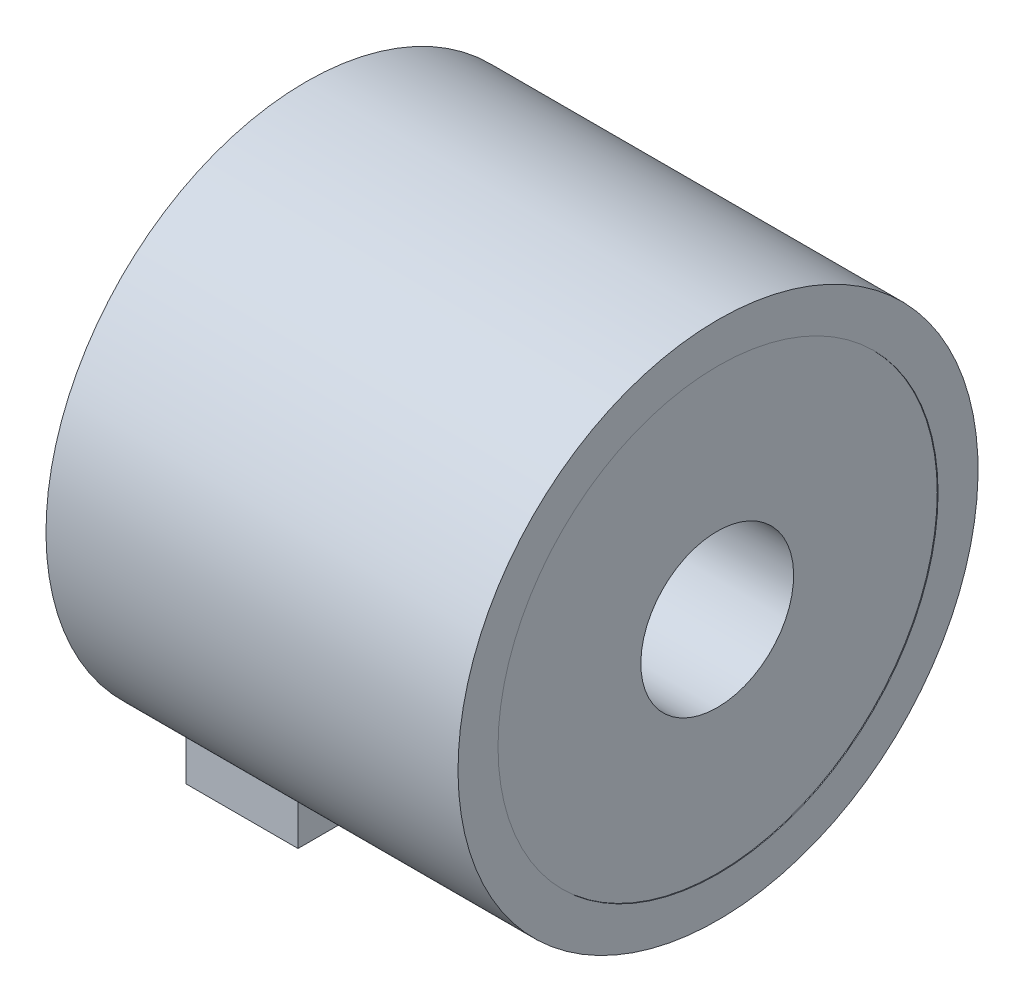
ISO-10303-21;
HEADER;
FILE_DESCRIPTION(('STEP AP214'),'2;1');
FILE_NAME('part.step','',(''),(''),'','','');
FILE_SCHEMA(('AUTOMOTIVE_DESIGN { 1 0 10303 214 1 1 1 1 }'));
ENDSEC;
DATA;
#1=APPLICATION_CONTEXT('core data for automotive mechanical design processes');
#2=APPLICATION_PROTOCOL_DEFINITION('international standard','automotive_design',2000,#1);
#3=PRODUCT_CONTEXT('',#1,'mechanical');
#4=PRODUCT('Part','Part','',(#3));
#5=PRODUCT_RELATED_PRODUCT_CATEGORY('part','',(#4));
#6=PRODUCT_DEFINITION_FORMATION('','',#4);
#7=PRODUCT_DEFINITION_CONTEXT('part definition',#1,'design');
#8=PRODUCT_DEFINITION('design','',#6,#7);
#9=PRODUCT_DEFINITION_SHAPE('','',#8);
#10=(LENGTH_UNIT() NAMED_UNIT(*) SI_UNIT(.MILLI.,.METRE.));
#11=(NAMED_UNIT(*) PLANE_ANGLE_UNIT() SI_UNIT($,.RADIAN.));
#12=(NAMED_UNIT(*) SI_UNIT($,.STERADIAN.) SOLID_ANGLE_UNIT());
#13=UNCERTAINTY_MEASURE_WITH_UNIT(LENGTH_MEASURE(1.E-05),#10,'distance_accuracy_value','');
#14=(GEOMETRIC_REPRESENTATION_CONTEXT(3) GLOBAL_UNCERTAINTY_ASSIGNED_CONTEXT((#13)) GLOBAL_UNIT_ASSIGNED_CONTEXT((#10,
#11,#12)) REPRESENTATION_CONTEXT('',''));
#15=CARTESIAN_POINT('',(0.,0.,0.));
#16=DIRECTION('',(0.,0.,1.));
#17=DIRECTION('',(1.,0.,0.));
#18=AXIS2_PLACEMENT_3D('',#15,#16,#17);
#19=CARTESIAN_POINT('',(-7.1882,0.,0.));
#20=DIRECTION('',(1.,0.,0.));
#21=DIRECTION('',(0.,0.,1.));
#22=AXIS2_PLACEMENT_3D('',#19,#20,#21);
#23=PLANE('',#22);
#24=CARTESIAN_POINT('',(-7.1882,0.,0.));
#25=DIRECTION('',(-1.,0.,0.));
#26=DIRECTION('',(0.,1.,0.));
#27=AXIS2_PLACEMENT_3D('',#24,#25,#26);
#28=CIRCLE('',#27,2.4257);
#29=CARTESIAN_POINT('',(-7.1882,-2.4257,0.));
#30=VERTEX_POINT('',#29);
#31=EDGE_CURVE('E132',#30,#30,#28,.T.);
#32=ORIENTED_EDGE('',*,*,#31,.T.);
#33=EDGE_LOOP('',(#32));
#34=FACE_BOUND('',#33,.T.);
#35=CARTESIAN_POINT('',(-7.1882,0.,0.));
#36=DIRECTION('',(1.,0.,0.));
#37=DIRECTION('',(0.,1.,0.));
#38=AXIS2_PLACEMENT_3D('',#35,#36,#37);
#39=CIRCLE('',#38,6.985);
#40=CARTESIAN_POINT('',(-7.1882,6.985,0.));
#41=VERTEX_POINT('',#40);
#42=EDGE_CURVE('E123',#41,#41,#39,.T.);
#43=ORIENTED_EDGE('',*,*,#42,.T.);
#44=EDGE_LOOP('',(#43));
#45=FACE_BOUND('',#44,.T.);
#46=ADVANCED_FACE('F17',(#34,#45),#23,.T.);
#47=CARTESIAN_POINT('',(-20.2184,0.,0.));
#48=DIRECTION('',(-1.,0.,0.));
#49=DIRECTION('',(0.,0.,1.));
#50=AXIS2_PLACEMENT_3D('',#47,#48,#49);
#51=PLANE('',#50);
#52=CARTESIAN_POINT('',(-20.2184,0.,0.));
#53=DIRECTION('',(1.,0.,0.));
#54=DIRECTION('',(0.,-1.,0.));
#55=AXIS2_PLACEMENT_3D('',#52,#53,#54);
#56=CIRCLE('',#55,2.4257);
#57=CARTESIAN_POINT('',(-20.2184,-2.4257,0.));
#58=VERTEX_POINT('',#57);
#59=EDGE_CURVE('E135',#58,#58,#56,.T.);
#60=ORIENTED_EDGE('',*,*,#59,.T.);
#61=EDGE_LOOP('',(#60));
#62=FACE_BOUND('',#61,.T.);
#63=CARTESIAN_POINT('',(-20.2184,0.,0.));
#64=DIRECTION('',(-1.,0.,0.));
#65=DIRECTION('',(0.,-1.,0.));
#66=AXIS2_PLACEMENT_3D('',#63,#64,#65);
#67=CIRCLE('',#66,6.985);
#68=CARTESIAN_POINT('',(-20.2184,-6.985,0.));
#69=VERTEX_POINT('',#68);
#70=EDGE_CURVE('E109',#69,#69,#67,.T.);
#71=ORIENTED_EDGE('',*,*,#70,.T.);
#72=EDGE_LOOP('',(#71));
#73=FACE_BOUND('',#72,.T.);
#74=ADVANCED_FACE('F311',(#62,#73),#51,.T.);
#75=CARTESIAN_POINT('',(-17.9578,-8.128,0.5588));
#76=DIRECTION('',(0.,-1.,0.));
#77=DIRECTION('',(-1.,0.,0.));
#78=AXIS2_PLACEMENT_3D('',#75,#76,#77);
#79=PLANE('',#78);
#80=CARTESIAN_POINT('',(-17.9578,-8.128,0.5588));
#81=DIRECTION('',(0.,-1.,0.));
#82=DIRECTION('',(0.,0.,1.));
#83=AXIS2_PLACEMENT_3D('',#80,#81,#82);
#84=CIRCLE('',#83,0.508);
#85=CARTESIAN_POINT('',(-17.9578,-8.128,1.0668));
#86=VERTEX_POINT('',#85);
#87=EDGE_CURVE('E108',#86,#86,#84,.T.);
#88=ORIENTED_EDGE('',*,*,#87,.T.);
#89=EDGE_LOOP('',(#88));
#90=FACE_BOUND('',#89,.T.);
#91=ADVANCED_FACE('F307',(#90),#79,.T.);
#92=CARTESIAN_POINT('',(-17.9578,-8.128,-0.5588));
#93=DIRECTION('',(0.,-1.,0.));
#94=DIRECTION('',(-1.,0.,0.));
#95=AXIS2_PLACEMENT_3D('',#92,#93,#94);
#96=PLANE('',#95);
#97=CARTESIAN_POINT('',(-17.9578,-8.128,-0.5588));
#98=DIRECTION('',(0.,-1.,0.));
#99=DIRECTION('',(0.,0.,1.));
#100=AXIS2_PLACEMENT_3D('',#97,#98,#99);
#101=CIRCLE('',#100,0.508);
#102=CARTESIAN_POINT('',(-17.9578,-8.128,-0.0508));
#103=VERTEX_POINT('',#102);
#104=EDGE_CURVE('E125',#103,#103,#101,.T.);
#105=ORIENTED_EDGE('',*,*,#104,.T.);
#106=EDGE_LOOP('',(#105));
#107=FACE_BOUND('',#106,.T.);
#108=ADVANCED_FACE('F285',(#107),#96,.T.);
#109=CARTESIAN_POINT('',(-16.6878,-9.144,-3.81));
#110=DIRECTION('',(0.,-1.,0.));
#111=DIRECTION('',(-1.,0.,0.));
#112=AXIS2_PLACEMENT_3D('',#109,#110,#111);
#113=PLANE('',#112);
#114=CARTESIAN_POINT('',(-17.9578,-9.144,-0.5588));
#115=DIRECTION('',(0.,-1.,0.));
#116=DIRECTION('',(0.,0.,1.));
#117=AXIS2_PLACEMENT_3D('',#114,#115,#116);
#118=CIRCLE('',#117,0.508);
#119=CARTESIAN_POINT('',(-17.9578,-9.144,-0.0508));
#120=VERTEX_POINT('',#119);
#121=EDGE_CURVE('E127',#120,#120,#118,.T.);
#122=ORIENTED_EDGE('',*,*,#121,.F.);
#123=EDGE_LOOP('',(#122));
#124=FACE_BOUND('',#123,.T.);
#125=CARTESIAN_POINT('',(-17.9578,-9.144,0.5588));
#126=DIRECTION('',(0.,-1.,0.));
#127=DIRECTION('',(0.,0.,1.));
#128=AXIS2_PLACEMENT_3D('',#125,#126,#127);
#129=CIRCLE('',#128,0.508);
#130=CARTESIAN_POINT('',(-17.9578,-9.144,1.0668));
#131=VERTEX_POINT('',#130);
#132=EDGE_CURVE('E116',#131,#131,#129,.T.);
#133=ORIENTED_EDGE('',*,*,#132,.F.);
#134=EDGE_LOOP('',(#133));
#135=FACE_BOUND('',#134,.T.);
#136=DIRECTION('',(1.,0.,0.));
#137=VECTOR('',#136,1.);
#138=CARTESIAN_POINT('',(-20.2438,-9.144,-3.81));
#139=LINE('',#138,#137);
#140=CARTESIAN_POINT('',(-20.2438,-9.144,-3.81));
#141=VERTEX_POINT('',#140);
#142=CARTESIAN_POINT('',(-16.6878,-9.144,-3.81));
#143=VERTEX_POINT('',#142);
#144=EDGE_CURVE('E131',#141,#143,#139,.T.);
#145=ORIENTED_EDGE('',*,*,#144,.T.);
#146=DIRECTION('',(0.,0.,1.));
#147=VECTOR('',#146,1.);
#148=CARTESIAN_POINT('',(-16.6878,-9.144,-3.81));
#149=LINE('',#148,#147);
#150=CARTESIAN_POINT('',(-16.6878,-9.144,3.81));
#151=VERTEX_POINT('',#150);
#152=EDGE_CURVE('E28',#143,#151,#149,.T.);
#153=ORIENTED_EDGE('',*,*,#152,.T.);
#154=DIRECTION('',(-1.,0.,0.));
#155=VECTOR('',#154,1.);
#156=CARTESIAN_POINT('',(-16.6878,-9.144,3.81));
#157=LINE('',#156,#155);
#158=CARTESIAN_POINT('',(-20.2438,-9.144,3.81));
#159=VERTEX_POINT('',#158);
#160=EDGE_CURVE('E11',#151,#159,#157,.T.);
#161=ORIENTED_EDGE('',*,*,#160,.T.);
#162=DIRECTION('',(0.,0.,-1.));
#163=VECTOR('',#162,1.);
#164=CARTESIAN_POINT('',(-20.2438,-9.144,3.81));
#165=LINE('',#164,#163);
#166=EDGE_CURVE('E151',#159,#141,#165,.T.);
#167=ORIENTED_EDGE('',*,*,#166,.T.);
#168=EDGE_LOOP('',(#145,#153,#161,#167));
#169=FACE_BOUND('',#168,.T.);
#170=ADVANCED_FACE('F273',(#124,#135,#169),#113,.T.);
#171=CARTESIAN_POINT('',(-16.6878,-9.144,3.81));
#172=DIRECTION('',(0.,0.,-1.));
#173=DIRECTION('',(-1.,0.,0.));
#174=AXIS2_PLACEMENT_3D('',#171,#172,#173);
#175=PLANE('',#174);
#176=DIRECTION('',(1.,0.,0.));
#177=VECTOR('',#176,1.);
#178=CARTESIAN_POINT('',(-7.1628,-7.32317724761596,3.81));
#179=LINE('',#178,#177);
#180=CARTESIAN_POINT('',(-20.2438,-7.32317724761596,3.81));
#181=VERTEX_POINT('',#180);
#182=CARTESIAN_POINT('',(-16.6878,-7.32317724761596,3.81));
#183=VERTEX_POINT('',#182);
#184=EDGE_CURVE('E136',#181,#183,#179,.T.);
#185=ORIENTED_EDGE('',*,*,#184,.F.);
#186=DIRECTION('',(0.,1.,0.));
#187=VECTOR('',#186,1.);
#188=CARTESIAN_POINT('',(-20.2438,-9.144,3.81));
#189=LINE('',#188,#187);
#190=EDGE_CURVE('E148',#159,#181,#189,.T.);
#191=ORIENTED_EDGE('',*,*,#190,.F.);
#192=ORIENTED_EDGE('',*,*,#160,.F.);
#193=DIRECTION('',(0.,1.,0.));
#194=VECTOR('',#193,1.);
#195=CARTESIAN_POINT('',(-16.6878,-9.144,3.81));
#196=LINE('',#195,#194);
#197=EDGE_CURVE('E128',#151,#183,#196,.T.);
#198=ORIENTED_EDGE('',*,*,#197,.T.);
#199=EDGE_LOOP('',(#185,#191,#192,#198));
#200=FACE_BOUND('',#199,.T.);
#201=ADVANCED_FACE('F194',(#200),#175,.F.);
#202=CARTESIAN_POINT('',(-16.6878,-9.144,-3.81));
#203=DIRECTION('',(-1.,0.,0.));
#204=DIRECTION('',(0.,0.,1.));
#205=AXIS2_PLACEMENT_3D('',#202,#203,#204);
#206=PLANE('',#205);
#207=CARTESIAN_POINT('',(-16.6878,0.,0.));
#208=DIRECTION('',(1.,0.,0.));
#209=DIRECTION('',(0.,-1.,0.));
#210=AXIS2_PLACEMENT_3D('',#207,#208,#209);
#211=CIRCLE('',#210,8.255);
#212=CARTESIAN_POINT('',(-16.6878,-7.32317724761596,-3.81));
#213=VERTEX_POINT('',#212);
#214=EDGE_CURVE('E137',#183,#213,#211,.T.);
#215=ORIENTED_EDGE('',*,*,#214,.F.);
#216=ORIENTED_EDGE('',*,*,#197,.F.);
#217=ORIENTED_EDGE('',*,*,#152,.F.);
#218=DIRECTION('',(0.,1.,0.));
#219=VECTOR('',#218,1.);
#220=CARTESIAN_POINT('',(-16.6878,-9.144,-3.81));
#221=LINE('',#220,#219);
#222=EDGE_CURVE('E146',#143,#213,#221,.T.);
#223=ORIENTED_EDGE('',*,*,#222,.T.);
#224=EDGE_LOOP('',(#215,#216,#217,#223));
#225=FACE_BOUND('',#224,.T.);
#226=ADVANCED_FACE('F19',(#225),#206,.F.);
#227=CARTESIAN_POINT('',(-20.2438,-9.144,-3.81));
#228=DIRECTION('',(0.,0.,1.));
#229=DIRECTION('',(1.,0.,0.));
#230=AXIS2_PLACEMENT_3D('',#227,#228,#229);
#231=PLANE('',#230);
#232=DIRECTION('',(-1.,0.,0.));
#233=VECTOR('',#232,1.);
#234=CARTESIAN_POINT('',(-7.1628,-7.32317724761596,-3.81));
#235=LINE('',#234,#233);
#236=CARTESIAN_POINT('',(-20.2438,-7.32317724761596,-3.81));
#237=VERTEX_POINT('',#236);
#238=EDGE_CURVE('E141',#213,#237,#235,.T.);
#239=ORIENTED_EDGE('',*,*,#238,.F.);
#240=ORIENTED_EDGE('',*,*,#222,.F.);
#241=ORIENTED_EDGE('',*,*,#144,.F.);
#242=DIRECTION('',(0.,1.,0.));
#243=VECTOR('',#242,1.);
#244=CARTESIAN_POINT('',(-20.2438,-9.144,-3.81));
#245=LINE('',#244,#243);
#246=EDGE_CURVE('E149',#141,#237,#245,.T.);
#247=ORIENTED_EDGE('',*,*,#246,.T.);
#248=EDGE_LOOP('',(#239,#240,#241,#247));
#249=FACE_BOUND('',#248,.T.);
#250=ADVANCED_FACE('F389',(#249),#231,.F.);
#251=CARTESIAN_POINT('',(-20.2438,0.,0.));
#252=DIRECTION('',(-1.,0.,0.));
#253=DIRECTION('',(0.,0.,1.));
#254=AXIS2_PLACEMENT_3D('',#251,#252,#253);
#255=PLANE('',#254);
#256=CARTESIAN_POINT('',(-20.2438,0.,0.));
#257=DIRECTION('',(-1.,0.,0.));
#258=DIRECTION('',(0.,-1.,0.));
#259=AXIS2_PLACEMENT_3D('',#256,#257,#258);
#260=CIRCLE('',#259,6.985);
#261=CARTESIAN_POINT('',(-20.2438,-6.985,0.));
#262=VERTEX_POINT('',#261);
#263=EDGE_CURVE('E103',#262,#262,#260,.T.);
#264=ORIENTED_EDGE('',*,*,#263,.F.);
#265=EDGE_LOOP('',(#264));
#266=FACE_BOUND('',#265,.T.);
#267=CARTESIAN_POINT('',(-20.2438,0.,0.));
#268=DIRECTION('',(-1.,0.,0.));
#269=DIRECTION('',(0.,-1.,0.));
#270=AXIS2_PLACEMENT_3D('',#267,#268,#269);
#271=CIRCLE('',#270,8.255);
#272=EDGE_CURVE('E145',#181,#237,#271,.T.);
#273=ORIENTED_EDGE('',*,*,#272,.T.);
#274=ORIENTED_EDGE('',*,*,#246,.F.);
#275=ORIENTED_EDGE('',*,*,#166,.F.);
#276=ORIENTED_EDGE('',*,*,#190,.T.);
#277=EDGE_LOOP('',(#273,#274,#275,#276));
#278=FACE_BOUND('',#277,.T.);
#279=ADVANCED_FACE('F192',(#266,#278),#255,.T.);
#280=CARTESIAN_POINT('',(-7.1628,0.,0.));
#281=DIRECTION('',(-1.,0.,0.));
#282=DIRECTION('',(0.,0.,1.));
#283=AXIS2_PLACEMENT_3D('',#280,#281,#282);
#284=PLANE('',#283);
#285=CARTESIAN_POINT('',(-7.1628,0.,0.));
#286=DIRECTION('',(1.,0.,0.));
#287=DIRECTION('',(0.,1.,0.));
#288=AXIS2_PLACEMENT_3D('',#285,#286,#287);
#289=CIRCLE('',#288,6.985);
#290=CARTESIAN_POINT('',(-7.1628,6.985,0.));
#291=VERTEX_POINT('',#290);
#292=EDGE_CURVE('E119',#291,#291,#289,.T.);
#293=ORIENTED_EDGE('',*,*,#292,.F.);
#294=EDGE_LOOP('',(#293));
#295=FACE_BOUND('',#294,.T.);
#296=CARTESIAN_POINT('',(-7.1628,0.,0.));
#297=DIRECTION('',(-1.,0.,0.));
#298=DIRECTION('',(0.,-1.,0.));
#299=AXIS2_PLACEMENT_3D('',#296,#297,#298);
#300=CIRCLE('',#299,8.255);
#301=CARTESIAN_POINT('',(-7.1628,8.255,0.));
#302=VERTEX_POINT('',#301);
#303=EDGE_CURVE('E21',#302,#302,#300,.T.);
#304=ORIENTED_EDGE('',*,*,#303,.F.);
#305=EDGE_LOOP('',(#304));
#306=FACE_BOUND('',#305,.T.);
#307=ADVANCED_FACE('F388',(#295,#306),#284,.F.);
#308=CARTESIAN_POINT('',(-7.1628,0.,0.));
#309=DIRECTION('',(-1.,0.,0.));
#310=DIRECTION('',(0.,-1.,0.));
#311=AXIS2_PLACEMENT_3D('',#308,#309,#310);
#312=CYLINDRICAL_SURFACE('',#311,2.4257);
#313=ORIENTED_EDGE('',*,*,#59,.F.);
#314=EDGE_LOOP('',(#313));
#315=FACE_BOUND('',#314,.T.);
#316=ORIENTED_EDGE('',*,*,#31,.F.);
#317=EDGE_LOOP('',(#316));
#318=FACE_BOUND('',#317,.T.);
#319=ADVANCED_FACE('F333',(#315,#318),#312,.F.);
#320=CARTESIAN_POINT('',(-7.1628,0.,0.));
#321=DIRECTION('',(-1.,0.,0.));
#322=DIRECTION('',(0.,-1.,0.));
#323=AXIS2_PLACEMENT_3D('',#320,#321,#322);
#324=CYLINDRICAL_SURFACE('',#323,8.255);
#325=ORIENTED_EDGE('',*,*,#214,.T.);
#326=ORIENTED_EDGE('',*,*,#238,.T.);
#327=ORIENTED_EDGE('',*,*,#272,.F.);
#328=ORIENTED_EDGE('',*,*,#184,.T.);
#329=EDGE_LOOP('',(#325,#326,#327,#328));
#330=FACE_BOUND('',#329,.T.);
#331=ORIENTED_EDGE('',*,*,#303,.T.);
#332=EDGE_LOOP('',(#331));
#333=FACE_BOUND('',#332,.T.);
#334=ADVANCED_FACE('F198',(#330,#333),#324,.T.);
#335=CARTESIAN_POINT('',(-17.9578,-8.128,-0.5588));
#336=DIRECTION('',(0.,-1.,0.));
#337=DIRECTION('',(0.,0.,1.));
#338=AXIS2_PLACEMENT_3D('',#335,#336,#337);
#339=CYLINDRICAL_SURFACE('',#338,0.508);
#340=ORIENTED_EDGE('',*,*,#121,.T.);
#341=EDGE_LOOP('',(#340));
#342=FACE_BOUND('',#341,.T.);
#343=ORIENTED_EDGE('',*,*,#104,.F.);
#344=EDGE_LOOP('',(#343));
#345=FACE_BOUND('',#344,.T.);
#346=ADVANCED_FACE('F298',(#342,#345),#339,.F.);
#347=CARTESIAN_POINT('',(-17.9578,-8.128,0.5588));
#348=DIRECTION('',(0.,-1.,0.));
#349=DIRECTION('',(0.,0.,1.));
#350=AXIS2_PLACEMENT_3D('',#347,#348,#349);
#351=CYLINDRICAL_SURFACE('',#350,0.508);
#352=ORIENTED_EDGE('',*,*,#132,.T.);
#353=EDGE_LOOP('',(#352));
#354=FACE_BOUND('',#353,.T.);
#355=ORIENTED_EDGE('',*,*,#87,.F.);
#356=EDGE_LOOP('',(#355));
#357=FACE_BOUND('',#356,.T.);
#358=ADVANCED_FACE('F294',(#354,#357),#351,.F.);
#359=CARTESIAN_POINT('',(-20.2184,0.,0.));
#360=DIRECTION('',(-1.,0.,0.));
#361=DIRECTION('',(0.,-1.,0.));
#362=AXIS2_PLACEMENT_3D('',#359,#360,#361);
#363=CYLINDRICAL_SURFACE('',#362,6.985);
#364=ORIENTED_EDGE('',*,*,#263,.T.);
#365=EDGE_LOOP('',(#364));
#366=FACE_BOUND('',#365,.T.);
#367=ORIENTED_EDGE('',*,*,#70,.F.);
#368=EDGE_LOOP('',(#367));
#369=FACE_BOUND('',#368,.T.);
#370=ADVANCED_FACE('F104',(#366,#369),#363,.F.);
#371=CARTESIAN_POINT('',(-7.1882,0.,0.));
#372=DIRECTION('',(1.,0.,0.));
#373=DIRECTION('',(0.,1.,0.));
#374=AXIS2_PLACEMENT_3D('',#371,#372,#373);
#375=CYLINDRICAL_SURFACE('',#374,6.985);
#376=ORIENTED_EDGE('',*,*,#292,.T.);
#377=EDGE_LOOP('',(#376));
#378=FACE_BOUND('',#377,.T.);
#379=ORIENTED_EDGE('',*,*,#42,.F.);
#380=EDGE_LOOP('',(#379));
#381=FACE_BOUND('',#380,.T.);
#382=ADVANCED_FACE('F355',(#378,#381),#375,.F.);
#383=CLOSED_SHELL('',(#46,#74,#91,#108,#170,#201,#226,#250,#279,#307,#319,#334,#346,#358,#370,#382));
#384=MANIFOLD_SOLID_BREP('B1',#383);
#385=ADVANCED_BREP_SHAPE_REPRESENTATION('',(#18,#384),#14);
#386=SHAPE_DEFINITION_REPRESENTATION(#9,#385);
ENDSEC;
END-ISO-10303-21;
